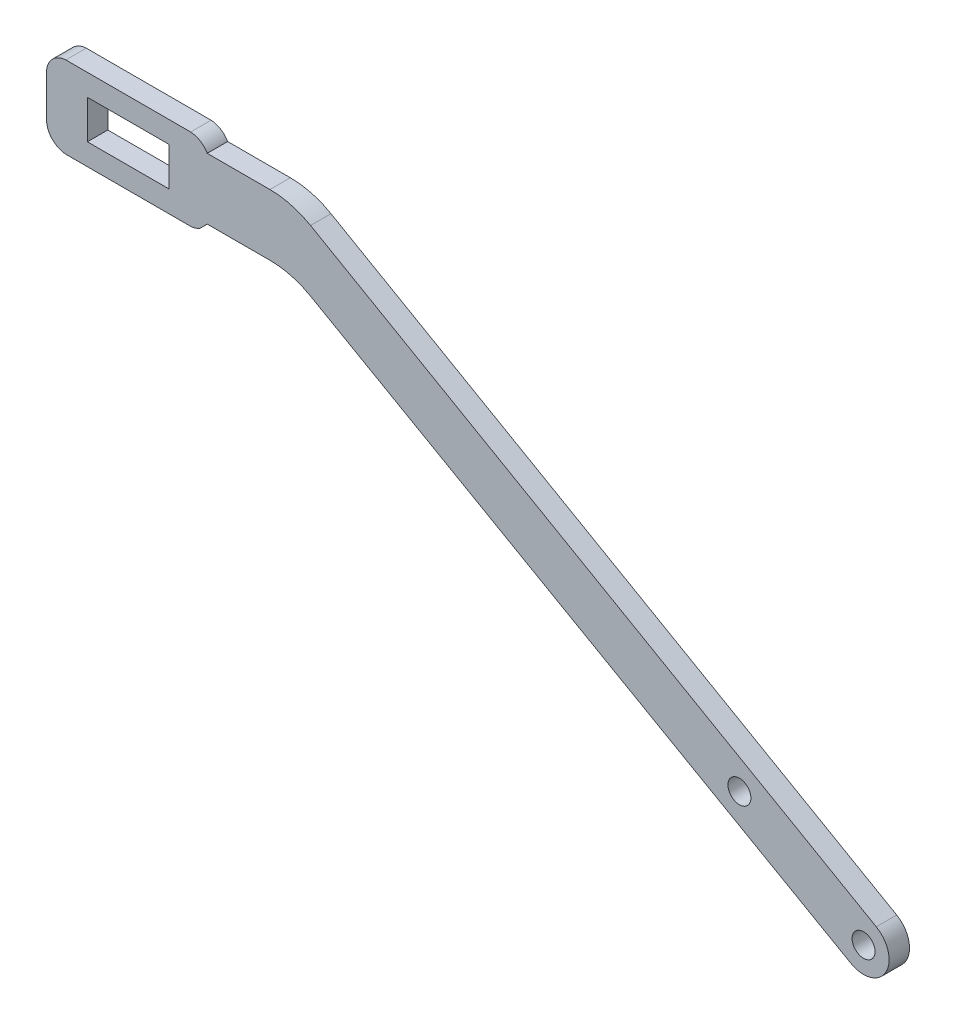
ISO-10303-21;
HEADER;
FILE_DESCRIPTION(('STEP AP214'),'2;1');
FILE_NAME('part.step','',(''),(''),'','','');
FILE_SCHEMA(('AUTOMOTIVE_DESIGN { 1 0 10303 214 1 1 1 1 }'));
ENDSEC;
DATA;
#1=APPLICATION_CONTEXT('core data for automotive mechanical design processes');
#2=APPLICATION_PROTOCOL_DEFINITION('international standard','automotive_design',2000,#1);
#3=PRODUCT_CONTEXT('',#1,'mechanical');
#4=PRODUCT('Part','Part','',(#3));
#5=PRODUCT_RELATED_PRODUCT_CATEGORY('part','',(#4));
#6=PRODUCT_DEFINITION_FORMATION('','',#4);
#7=PRODUCT_DEFINITION_CONTEXT('part definition',#1,'design');
#8=PRODUCT_DEFINITION('design','',#6,#7);
#9=PRODUCT_DEFINITION_SHAPE('','',#8);
#10=(LENGTH_UNIT() NAMED_UNIT(*) SI_UNIT(.MILLI.,.METRE.));
#11=(NAMED_UNIT(*) PLANE_ANGLE_UNIT() SI_UNIT($,.RADIAN.));
#12=(NAMED_UNIT(*) SI_UNIT($,.STERADIAN.) SOLID_ANGLE_UNIT());
#13=UNCERTAINTY_MEASURE_WITH_UNIT(LENGTH_MEASURE(1.E-05),#10,'distance_accuracy_value','');
#14=(GEOMETRIC_REPRESENTATION_CONTEXT(3) GLOBAL_UNCERTAINTY_ASSIGNED_CONTEXT((#13)) GLOBAL_UNIT_ASSIGNED_CONTEXT((#10,
#11,#12)) REPRESENTATION_CONTEXT('',''));
#15=CARTESIAN_POINT('',(0.,0.,0.));
#16=DIRECTION('',(0.,0.,1.));
#17=DIRECTION('',(1.,0.,0.));
#18=AXIS2_PLACEMENT_3D('',#15,#16,#17);
#19=CARTESIAN_POINT('',(-46.2356020455662,14.881853558672,3.175));
#20=DIRECTION('',(0.,0.,-1.));
#21=DIRECTION('',(-1.,0.,0.));
#22=AXIS2_PLACEMENT_3D('',#19,#20,#21);
#23=PLANE('',#22);
#24=DIRECTION('',(-0.867434207369296,0.497551902705237,0.));
#25=VECTOR('',#24,1.);
#26=CARTESIAN_POINT('',(-11.3062939995603,22.8218408101932,3.175));
#27=LINE('',#26,#25);
#28=CARTESIAN_POINT('',(79.5640570682952,-29.3005169308311,3.175));
#29=VERTEX_POINT('',#28);
#30=CARTESIAN_POINT('',(-8.37112341052855,21.1382552437832,3.175));
#31=VERTEX_POINT('',#30);
#32=EDGE_CURVE('E227',#29,#31,#27,.T.);
#33=ORIENTED_EDGE('',*,*,#32,.T.);
#34=CARTESIAN_POINT('',(-14.6900325748851,10.1218408101932,3.175));
#35=DIRECTION('',(0.,0.,-1.));
#36=DIRECTION('',(-1.,0.,0.));
#37=AXIS2_PLACEMENT_3D('',#34,#35,#36);
#38=CIRCLE('',#37,12.7);
#39=CARTESIAN_POINT('',(-14.6900325748851,22.8218408101932,3.175));
#40=VERTEX_POINT('',#39);
#41=EDGE_CURVE('E308',#31,#40,#38,.F.);
#42=ORIENTED_EDGE('',*,*,#41,.T.);
#43=DIRECTION('',(-1.,0.,0.));
#44=VECTOR('',#43,1.);
#45=CARTESIAN_POINT('',(-11.3062939995603,22.8218408101932,3.175));
#46=LINE('',#45,#44);
#47=CARTESIAN_POINT('',(-24.4316633425447,22.8218408101932,3.175));
#48=VERTEX_POINT('',#47);
#49=EDGE_CURVE('E229',#40,#48,#46,.T.);
#50=ORIENTED_EDGE('',*,*,#49,.T.);
#51=CARTESIAN_POINT('',(-27.1856020455662,21.231853558672,3.175));
#52=DIRECTION('',(0.,0.,1.));
#53=DIRECTION('',(-1.,0.,0.));
#54=AXIS2_PLACEMENT_3D('',#51,#52,#53);
#55=CIRCLE('',#54,3.17997450304244);
#56=CARTESIAN_POINT('',(-27.0078020455662,24.406853558672,3.175));
#57=VERTEX_POINT('',#56);
#58=EDGE_CURVE('E231',#48,#57,#55,.T.);
#59=ORIENTED_EDGE('',*,*,#58,.T.);
#60=DIRECTION('',(-1.,0.,0.));
#61=VECTOR('',#60,1.);
#62=CARTESIAN_POINT('',(-27.0078020455662,24.406853558672,3.175));
#63=LINE('',#62,#61);
#64=CARTESIAN_POINT('',(-46.4134020455663,24.406853558672,3.175));
#65=VERTEX_POINT('',#64);
#66=EDGE_CURVE('E233',#57,#65,#63,.T.);
#67=ORIENTED_EDGE('',*,*,#66,.T.);
#68=CARTESIAN_POINT('',(-46.2356020455662,21.231853558672,3.175));
#69=DIRECTION('',(0.,0.,1.));
#70=DIRECTION('',(1.,0.,0.));
#71=AXIS2_PLACEMENT_3D('',#68,#69,#70);
#72=CIRCLE('',#71,3.17997450304244);
#73=CARTESIAN_POINT('',(-49.4155765486087,21.231853558672,3.175));
#74=VERTEX_POINT('',#73);
#75=EDGE_CURVE('E235',#65,#74,#72,.T.);
#76=ORIENTED_EDGE('',*,*,#75,.T.);
#77=DIRECTION('',(0.,-1.,0.));
#78=VECTOR('',#77,1.);
#79=CARTESIAN_POINT('',(-49.4155765486087,14.881853558672,3.175));
#80=LINE('',#79,#78);
#81=CARTESIAN_POINT('',(-49.4155765486087,14.881853558672,3.175));
#82=VERTEX_POINT('',#81);
#83=EDGE_CURVE('E237',#74,#82,#80,.T.);
#84=ORIENTED_EDGE('',*,*,#83,.T.);
#85=CARTESIAN_POINT('',(-46.2356020455662,14.881853558672,3.175));
#86=DIRECTION('',(0.,0.,1.));
#87=DIRECTION('',(-1.,0.,0.));
#88=AXIS2_PLACEMENT_3D('',#85,#86,#87);
#89=CIRCLE('',#88,3.17997450304244);
#90=CARTESIAN_POINT('',(-46.4134020455663,11.706853558672,3.175));
#91=VERTEX_POINT('',#90);
#92=EDGE_CURVE('E210',#82,#91,#89,.T.);
#93=ORIENTED_EDGE('',*,*,#92,.T.);
#94=DIRECTION('',(1.,0.,0.));
#95=VECTOR('',#94,1.);
#96=CARTESIAN_POINT('',(-27.0078020455662,11.706853558672,3.175));
#97=LINE('',#96,#95);
#98=CARTESIAN_POINT('',(-27.0078020455662,11.706853558672,3.175));
#99=VERTEX_POINT('',#98);
#100=EDGE_CURVE('E213',#91,#99,#97,.T.);
#101=ORIENTED_EDGE('',*,*,#100,.T.);
#102=CARTESIAN_POINT('',(-27.1856020455662,14.881853558672,3.175));
#103=DIRECTION('',(0.,0.,1.));
#104=DIRECTION('',(1.,0.,0.));
#105=AXIS2_PLACEMENT_3D('',#102,#103,#104);
#106=CIRCLE('',#105,3.17997450304244);
#107=CARTESIAN_POINT('',(-25.595614794045,12.1279148556504,3.175));
#108=VERTEX_POINT('',#107);
#109=EDGE_CURVE('E216',#99,#108,#106,.T.);
#110=ORIENTED_EDGE('',*,*,#109,.T.);
#111=DIRECTION('',(0.705597380355969,0.708612966883047,0.));
#112=VECTOR('',#111,1.);
#113=CARTESIAN_POINT('',(-25.595614794045,12.1279148556504,3.175));
#114=LINE('',#113,#112);
#115=CARTESIAN_POINT('',(-24.4316633425447,13.2968408101932,3.175));
#116=VERTEX_POINT('',#115);
#117=EDGE_CURVE('E218',#108,#116,#114,.T.);
#118=ORIENTED_EDGE('',*,*,#117,.T.);
#119=DIRECTION('',(1.,0.,0.));
#120=VECTOR('',#119,1.);
#121=CARTESIAN_POINT('',(-11.3062939995603,13.2968408101932,3.175));
#122=LINE('',#121,#120);
#123=CARTESIAN_POINT('',(-14.6679580258952,13.2968408101932,3.175));
#124=VERTEX_POINT('',#123);
#125=EDGE_CURVE('E220',#116,#124,#122,.T.);
#126=ORIENTED_EDGE('',*,*,#125,.T.);
#127=CARTESIAN_POINT('',(-14.6679580258952,0.596840810193181,3.175));
#128=DIRECTION('',(0.,0.,-1.));
#129=DIRECTION('',(-1.,0.,0.));
#130=AXIS2_PLACEMENT_3D('',#127,#128,#129);
#131=CIRCLE('',#130,12.7);
#132=CARTESIAN_POINT('',(-8.38485559112707,11.6337164457257,3.175));
#133=VERTEX_POINT('',#132);
#134=EDGE_CURVE('E11',#124,#133,#131,.T.);
#135=ORIENTED_EDGE('',*,*,#134,.T.);
#136=DIRECTION('',(0.869045325632478,-0.494732475178595,0.));
#137=VECTOR('',#136,1.);
#138=CARTESIAN_POINT('',(-11.3062939995603,13.2968408101932,3.175));
#139=LINE('',#138,#137);
#140=CARTESIAN_POINT('',(75.6259284435687,-36.1921700774319,3.175));
#141=VERTEX_POINT('',#140);
#142=EDGE_CURVE('E223',#133,#141,#139,.T.);
#143=ORIENTED_EDGE('',*,*,#142,.T.);
#144=CARTESIAN_POINT('',(77.5893979544337,-32.743146441328,3.175));
#145=DIRECTION('',(0.,0.,1.));
#146=DIRECTION('',(1.,0.,0.));
#147=AXIS2_PLACEMENT_3D('',#144,#145,#146);
#148=CIRCLE('',#147,3.96875);
#149=EDGE_CURVE('E225',#141,#29,#148,.T.);
#150=ORIENTED_EDGE('',*,*,#149,.T.);
#151=EDGE_LOOP('',(#33,#42,#50,#59,#67,#76,#84,#93,#101,#110,#118,#126,#135,#143,#150));
#152=FACE_BOUND('',#151,.T.);
#153=DIRECTION('',(0.,-1.,0.));
#154=VECTOR('',#153,1.);
#155=CARTESIAN_POINT('',(-43.0606020455662,15.059653558672,3.175));
#156=LINE('',#155,#154);
#157=CARTESIAN_POINT('',(-43.0606020455662,21.054053558672,3.175));
#158=VERTEX_POINT('',#157);
#159=CARTESIAN_POINT('',(-43.0606020455662,15.059653558672,3.175));
#160=VERTEX_POINT('',#159);
#161=EDGE_CURVE('E166',#158,#160,#156,.T.);
#162=ORIENTED_EDGE('',*,*,#161,.F.);
#163=DIRECTION('',(-1.,0.,0.));
#164=VECTOR('',#163,1.);
#165=CARTESIAN_POINT('',(-30.3606020455662,21.054053558672,3.175));
#166=LINE('',#165,#164);
#167=CARTESIAN_POINT('',(-30.3606020455662,21.054053558672,3.175));
#168=VERTEX_POINT('',#167);
#169=EDGE_CURVE('E192',#168,#158,#166,.T.);
#170=ORIENTED_EDGE('',*,*,#169,.F.);
#171=DIRECTION('',(0.,1.,0.));
#172=VECTOR('',#171,1.);
#173=CARTESIAN_POINT('',(-30.3606020455662,15.059653558672,3.175));
#174=LINE('',#173,#172);
#175=CARTESIAN_POINT('',(-30.3606020455662,15.059653558672,3.175));
#176=VERTEX_POINT('',#175);
#177=EDGE_CURVE('E190',#176,#168,#174,.T.);
#178=ORIENTED_EDGE('',*,*,#177,.F.);
#179=DIRECTION('',(1.,0.,0.));
#180=VECTOR('',#179,1.);
#181=CARTESIAN_POINT('',(-30.3606020455662,15.059653558672,3.175));
#182=LINE('',#181,#180);
#183=EDGE_CURVE('E176',#160,#176,#182,.T.);
#184=ORIENTED_EDGE('',*,*,#183,.F.);
#185=EDGE_LOOP('',(#162,#170,#178,#184));
#186=FACE_BOUND('',#185,.T.);
#187=CARTESIAN_POINT('',(77.5893979544337,-32.743146441328,3.175));
#188=DIRECTION('',(0.,0.,1.));
#189=DIRECTION('',(1.,0.,0.));
#190=AXIS2_PLACEMENT_3D('',#187,#188,#189);
#191=CIRCLE('',#190,1.7859375);
#192=CARTESIAN_POINT('',(79.3753354544338,-32.743146441328,3.175));
#193=VERTEX_POINT('',#192);
#194=EDGE_CURVE('E199',#193,#193,#191,.T.);
#195=ORIENTED_EDGE('',*,*,#194,.F.);
#196=EDGE_LOOP('',(#195));
#197=FACE_BOUND('',#196,.T.);
#198=CARTESIAN_POINT('',(58.2927437088372,-21.7163717575912,3.175));
#199=DIRECTION('',(0.,0.,1.));
#200=DIRECTION('',(1.,0.,0.));
#201=AXIS2_PLACEMENT_3D('',#198,#199,#200);
#202=CIRCLE('',#201,1.78600099999999);
#203=CARTESIAN_POINT('',(60.0787447088372,-21.7163717575912,3.175));
#204=VERTEX_POINT('',#203);
#205=EDGE_CURVE('E586',#204,#204,#202,.T.);
#206=ORIENTED_EDGE('',*,*,#205,.F.);
#207=EDGE_LOOP('',(#206));
#208=FACE_BOUND('',#207,.T.);
#209=ADVANCED_FACE('F33',(#152,#186,#197,#208),#23,.F.);
#210=CARTESIAN_POINT('',(-46.2356020455662,14.881853558672,0.));
#211=DIRECTION('',(0.,0.,-1.));
#212=DIRECTION('',(-1.,0.,0.));
#213=AXIS2_PLACEMENT_3D('',#210,#211,#212);
#214=PLANE('',#213);
#215=CARTESIAN_POINT('',(58.2927437088372,-21.7163717575912,0.));
#216=DIRECTION('',(0.,0.,1.));
#217=DIRECTION('',(1.,0.,0.));
#218=AXIS2_PLACEMENT_3D('',#215,#216,#217);
#219=CIRCLE('',#218,1.786001);
#220=CARTESIAN_POINT('',(60.0787447088372,-21.7163717575912,0.));
#221=VERTEX_POINT('',#220);
#222=EDGE_CURVE('E583',#221,#221,#219,.T.);
#223=ORIENTED_EDGE('',*,*,#222,.T.);
#224=EDGE_LOOP('',(#223));
#225=FACE_BOUND('',#224,.T.);
#226=DIRECTION('',(-1.,0.,0.));
#227=VECTOR('',#226,1.);
#228=CARTESIAN_POINT('',(-30.3606020455662,21.054053558672,0.));
#229=LINE('',#228,#227);
#230=CARTESIAN_POINT('',(-30.3606020455662,21.054053558672,0.));
#231=VERTEX_POINT('',#230);
#232=CARTESIAN_POINT('',(-43.0606020455662,21.054053558672,0.));
#233=VERTEX_POINT('',#232);
#234=EDGE_CURVE('E177',#231,#233,#229,.T.);
#235=ORIENTED_EDGE('',*,*,#234,.T.);
#236=DIRECTION('',(0.,-1.,0.));
#237=VECTOR('',#236,1.);
#238=CARTESIAN_POINT('',(-43.0606020455662,15.059653558672,0.));
#239=LINE('',#238,#237);
#240=CARTESIAN_POINT('',(-43.0606020455662,15.059653558672,0.));
#241=VERTEX_POINT('',#240);
#242=EDGE_CURVE('E197',#233,#241,#239,.T.);
#243=ORIENTED_EDGE('',*,*,#242,.T.);
#244=DIRECTION('',(1.,0.,0.));
#245=VECTOR('',#244,1.);
#246=CARTESIAN_POINT('',(-30.3606020455662,15.059653558672,0.));
#247=LINE('',#246,#245);
#248=CARTESIAN_POINT('',(-30.3606020455662,15.059653558672,0.));
#249=VERTEX_POINT('',#248);
#250=EDGE_CURVE('E183',#241,#249,#247,.T.);
#251=ORIENTED_EDGE('',*,*,#250,.T.);
#252=DIRECTION('',(0.,1.,0.));
#253=VECTOR('',#252,1.);
#254=CARTESIAN_POINT('',(-30.3606020455662,15.059653558672,0.));
#255=LINE('',#254,#253);
#256=EDGE_CURVE('E201',#249,#231,#255,.T.);
#257=ORIENTED_EDGE('',*,*,#256,.T.);
#258=EDGE_LOOP('',(#235,#243,#251,#257));
#259=FACE_BOUND('',#258,.T.);
#260=DIRECTION('',(-1.,0.,0.));
#261=VECTOR('',#260,1.);
#262=CARTESIAN_POINT('',(-11.3062939995603,22.8218408101932,0.));
#263=LINE('',#262,#261);
#264=CARTESIAN_POINT('',(-14.6900325748851,22.8218408101932,0.));
#265=VERTEX_POINT('',#264);
#266=CARTESIAN_POINT('',(-24.4316633425447,22.8218408101932,0.));
#267=VERTEX_POINT('',#266);
#268=EDGE_CURVE('E257',#265,#267,#263,.T.);
#269=ORIENTED_EDGE('',*,*,#268,.F.);
#270=CARTESIAN_POINT('',(-14.6900325748851,10.1218408101932,0.));
#271=DIRECTION('',(0.,0.,-1.));
#272=DIRECTION('',(-1.,0.,0.));
#273=AXIS2_PLACEMENT_3D('',#270,#271,#272);
#274=CIRCLE('',#273,12.7);
#275=CARTESIAN_POINT('',(-8.37112341052855,21.1382552437832,0.));
#276=VERTEX_POINT('',#275);
#277=EDGE_CURVE('E56',#265,#276,#274,.T.);
#278=ORIENTED_EDGE('',*,*,#277,.T.);
#279=DIRECTION('',(-0.867434207369296,0.497551902705237,0.));
#280=VECTOR('',#279,1.);
#281=CARTESIAN_POINT('',(-11.3062939995603,22.8218408101932,0.));
#282=LINE('',#281,#280);
#283=CARTESIAN_POINT('',(79.5640570682952,-29.3005169308311,0.));
#284=VERTEX_POINT('',#283);
#285=EDGE_CURVE('E255',#284,#276,#282,.T.);
#286=ORIENTED_EDGE('',*,*,#285,.F.);
#287=CARTESIAN_POINT('',(77.5893979544337,-32.743146441328,0.));
#288=DIRECTION('',(0.,0.,1.));
#289=DIRECTION('',(1.,0.,0.));
#290=AXIS2_PLACEMENT_3D('',#287,#288,#289);
#291=CIRCLE('',#290,3.96875);
#292=CARTESIAN_POINT('',(75.6259284435687,-36.1921700774319,0.));
#293=VERTEX_POINT('',#292);
#294=EDGE_CURVE('E253',#293,#284,#291,.T.);
#295=ORIENTED_EDGE('',*,*,#294,.F.);
#296=DIRECTION('',(0.869045325632478,-0.494732475178595,0.));
#297=VECTOR('',#296,1.);
#298=CARTESIAN_POINT('',(12.4117912426417,-0.20545495307046,0.));
#299=LINE('',#298,#297);
#300=CARTESIAN_POINT('',(-8.38485559112706,11.6337164457257,0.));
#301=VERTEX_POINT('',#300);
#302=EDGE_CURVE('E251',#301,#293,#299,.T.);
#303=ORIENTED_EDGE('',*,*,#302,.F.);
#304=CARTESIAN_POINT('',(-14.6679580258952,0.596840810193181,0.));
#305=DIRECTION('',(0.,0.,-1.));
#306=DIRECTION('',(-1.,0.,0.));
#307=AXIS2_PLACEMENT_3D('',#304,#305,#306);
#308=CIRCLE('',#307,12.7);
#309=CARTESIAN_POINT('',(-14.6679580258952,13.2968408101932,0.));
#310=VERTEX_POINT('',#309);
#311=EDGE_CURVE('E41',#301,#310,#308,.F.);
#312=ORIENTED_EDGE('',*,*,#311,.T.);
#313=DIRECTION('',(1.,0.,0.));
#314=VECTOR('',#313,1.);
#315=CARTESIAN_POINT('',(-11.3062939995603,13.2968408101932,0.));
#316=LINE('',#315,#314);
#317=CARTESIAN_POINT('',(-24.4316633425447,13.2968408101932,0.));
#318=VERTEX_POINT('',#317);
#319=EDGE_CURVE('E248',#318,#310,#316,.T.);
#320=ORIENTED_EDGE('',*,*,#319,.F.);
#321=DIRECTION('',(0.705597380355969,0.708612966883047,0.));
#322=VECTOR('',#321,1.);
#323=CARTESIAN_POINT('',(-25.595614794045,12.1279148556504,0.));
#324=LINE('',#323,#322);
#325=CARTESIAN_POINT('',(-25.595614794045,12.1279148556504,0.));
#326=VERTEX_POINT('',#325);
#327=EDGE_CURVE('E246',#326,#318,#324,.T.);
#328=ORIENTED_EDGE('',*,*,#327,.F.);
#329=CARTESIAN_POINT('',(-27.1856020455662,14.881853558672,0.));
#330=DIRECTION('',(0.,0.,1.));
#331=DIRECTION('',(1.,0.,0.));
#332=AXIS2_PLACEMENT_3D('',#329,#330,#331);
#333=CIRCLE('',#332,3.17997450304244);
#334=CARTESIAN_POINT('',(-27.0078020455662,11.706853558672,0.));
#335=VERTEX_POINT('',#334);
#336=EDGE_CURVE('E244',#335,#326,#333,.T.);
#337=ORIENTED_EDGE('',*,*,#336,.F.);
#338=DIRECTION('',(1.,0.,0.));
#339=VECTOR('',#338,1.);
#340=CARTESIAN_POINT('',(-27.0078020455662,11.706853558672,0.));
#341=LINE('',#340,#339);
#342=CARTESIAN_POINT('',(-46.4134020455663,11.706853558672,0.));
#343=VERTEX_POINT('',#342);
#344=EDGE_CURVE('E242',#343,#335,#341,.T.);
#345=ORIENTED_EDGE('',*,*,#344,.F.);
#346=CARTESIAN_POINT('',(-46.2356020455662,14.881853558672,0.));
#347=DIRECTION('',(0.,0.,1.));
#348=DIRECTION('',(-1.,0.,0.));
#349=AXIS2_PLACEMENT_3D('',#346,#347,#348);
#350=CIRCLE('',#349,3.17997450304244);
#351=CARTESIAN_POINT('',(-49.4155765486087,14.881853558672,0.));
#352=VERTEX_POINT('',#351);
#353=EDGE_CURVE('E184',#352,#343,#350,.T.);
#354=ORIENTED_EDGE('',*,*,#353,.F.);
#355=DIRECTION('',(0.,-1.,0.));
#356=VECTOR('',#355,1.);
#357=CARTESIAN_POINT('',(-49.4155765486087,14.881853558672,0.));
#358=LINE('',#357,#356);
#359=CARTESIAN_POINT('',(-49.4155765486087,21.231853558672,0.));
#360=VERTEX_POINT('',#359);
#361=EDGE_CURVE('E214',#360,#352,#358,.T.);
#362=ORIENTED_EDGE('',*,*,#361,.F.);
#363=CARTESIAN_POINT('',(-46.2356020455662,21.231853558672,0.));
#364=DIRECTION('',(0.,0.,1.));
#365=DIRECTION('',(1.,0.,0.));
#366=AXIS2_PLACEMENT_3D('',#363,#364,#365);
#367=CIRCLE('',#366,3.17997450304244);
#368=CARTESIAN_POINT('',(-46.4134020455663,24.406853558672,0.));
#369=VERTEX_POINT('',#368);
#370=EDGE_CURVE('E263',#369,#360,#367,.T.);
#371=ORIENTED_EDGE('',*,*,#370,.F.);
#372=DIRECTION('',(-1.,0.,0.));
#373=VECTOR('',#372,1.);
#374=CARTESIAN_POINT('',(-27.0078020455662,24.406853558672,0.));
#375=LINE('',#374,#373);
#376=CARTESIAN_POINT('',(-27.0078020455662,24.406853558672,0.));
#377=VERTEX_POINT('',#376);
#378=EDGE_CURVE('E261',#377,#369,#375,.T.);
#379=ORIENTED_EDGE('',*,*,#378,.F.);
#380=CARTESIAN_POINT('',(-27.1856020455662,21.231853558672,0.));
#381=DIRECTION('',(0.,0.,1.));
#382=DIRECTION('',(-1.,0.,0.));
#383=AXIS2_PLACEMENT_3D('',#380,#381,#382);
#384=CIRCLE('',#383,3.17997450304244);
#385=EDGE_CURVE('E259',#267,#377,#384,.T.);
#386=ORIENTED_EDGE('',*,*,#385,.F.);
#387=EDGE_LOOP('',(#269,#278,#286,#295,#303,#312,#320,#328,#337,#345,#354,#362,#371,#379,#386));
#388=FACE_BOUND('',#387,.T.);
#389=CARTESIAN_POINT('',(77.5893979544337,-32.743146441328,0.));
#390=DIRECTION('',(0.,0.,1.));
#391=DIRECTION('',(1.,0.,0.));
#392=AXIS2_PLACEMENT_3D('',#389,#390,#391);
#393=CIRCLE('',#392,1.7859375);
#394=CARTESIAN_POINT('',(79.3753354544338,-32.743146441328,0.));
#395=VERTEX_POINT('',#394);
#396=EDGE_CURVE('E589',#395,#395,#393,.T.);
#397=ORIENTED_EDGE('',*,*,#396,.T.);
#398=EDGE_LOOP('',(#397));
#399=FACE_BOUND('',#398,.T.);
#400=ADVANCED_FACE('F311',(#225,#259,#388,#399),#214,.T.);
#401=CARTESIAN_POINT('',(-46.2356020455662,14.881853558672,3.175));
#402=DIRECTION('',(0.,0.,-1.));
#403=DIRECTION('',(-1.,0.,0.));
#404=AXIS2_PLACEMENT_3D('',#401,#402,#403);
#405=CYLINDRICAL_SURFACE('',#404,3.17997450304244);
#406=ORIENTED_EDGE('',*,*,#353,.T.);
#407=DIRECTION('',(0.,0.,-1.));
#408=VECTOR('',#407,1.);
#409=CARTESIAN_POINT('',(-46.4134020455663,11.706853558672,3.175));
#410=LINE('',#409,#408);
#411=EDGE_CURVE('E295',#91,#343,#410,.T.);
#412=ORIENTED_EDGE('',*,*,#411,.F.);
#413=ORIENTED_EDGE('',*,*,#92,.F.);
#414=DIRECTION('',(0.,0.,-1.));
#415=VECTOR('',#414,1.);
#416=CARTESIAN_POINT('',(-49.4155765486087,14.881853558672,3.175));
#417=LINE('',#416,#415);
#418=EDGE_CURVE('E239',#82,#352,#417,.T.);
#419=ORIENTED_EDGE('',*,*,#418,.T.);
#420=EDGE_LOOP('',(#406,#412,#413,#419));
#421=FACE_BOUND('',#420,.T.);
#422=ADVANCED_FACE('F364',(#421),#405,.T.);
#423=CARTESIAN_POINT('',(-27.0078020455662,11.706853558672,3.175));
#424=DIRECTION('',(0.,1.,0.));
#425=DIRECTION('',(-1.,0.,0.));
#426=AXIS2_PLACEMENT_3D('',#423,#424,#425);
#427=PLANE('',#426);
#428=ORIENTED_EDGE('',*,*,#344,.T.);
#429=DIRECTION('',(0.,0.,-1.));
#430=VECTOR('',#429,1.);
#431=CARTESIAN_POINT('',(-27.0078020455662,11.706853558672,3.175));
#432=LINE('',#431,#430);
#433=EDGE_CURVE('E292',#99,#335,#432,.T.);
#434=ORIENTED_EDGE('',*,*,#433,.F.);
#435=ORIENTED_EDGE('',*,*,#100,.F.);
#436=ORIENTED_EDGE('',*,*,#411,.T.);
#437=EDGE_LOOP('',(#428,#434,#435,#436));
#438=FACE_BOUND('',#437,.T.);
#439=ADVANCED_FACE('F369',(#438),#427,.F.);
#440=CARTESIAN_POINT('',(-27.1856020455662,14.881853558672,3.175));
#441=DIRECTION('',(0.,0.,-1.));
#442=DIRECTION('',(-1.,0.,0.));
#443=AXIS2_PLACEMENT_3D('',#440,#441,#442);
#444=CYLINDRICAL_SURFACE('',#443,3.17997450304244);
#445=ORIENTED_EDGE('',*,*,#336,.T.);
#446=DIRECTION('',(0.,0.,-1.));
#447=VECTOR('',#446,1.);
#448=CARTESIAN_POINT('',(-25.595614794045,12.1279148556504,3.175));
#449=LINE('',#448,#447);
#450=EDGE_CURVE('E289',#108,#326,#449,.T.);
#451=ORIENTED_EDGE('',*,*,#450,.F.);
#452=ORIENTED_EDGE('',*,*,#109,.F.);
#453=ORIENTED_EDGE('',*,*,#433,.T.);
#454=EDGE_LOOP('',(#445,#451,#452,#453));
#455=FACE_BOUND('',#454,.T.);
#456=ADVANCED_FACE('F372',(#455),#444,.T.);
#457=CARTESIAN_POINT('',(-25.595614794045,12.1279148556504,3.175));
#458=DIRECTION('',(-0.708612966883047,0.705597380355969,0.));
#459=DIRECTION('',(-0.705597380355969,-0.708612966883047,0.));
#460=AXIS2_PLACEMENT_3D('',#457,#458,#459);
#461=PLANE('',#460);
#462=ORIENTED_EDGE('',*,*,#327,.T.);
#463=DIRECTION('',(0.,0.,-1.));
#464=VECTOR('',#463,1.);
#465=CARTESIAN_POINT('',(-24.4316633425447,13.2968408101932,3.175));
#466=LINE('',#465,#464);
#467=EDGE_CURVE('E286',#116,#318,#466,.T.);
#468=ORIENTED_EDGE('',*,*,#467,.F.);
#469=ORIENTED_EDGE('',*,*,#117,.F.);
#470=ORIENTED_EDGE('',*,*,#450,.T.);
#471=EDGE_LOOP('',(#462,#468,#469,#470));
#472=FACE_BOUND('',#471,.T.);
#473=ADVANCED_FACE('F375',(#472),#461,.F.);
#474=CARTESIAN_POINT('',(-11.3062939995603,13.2968408101932,3.175));
#475=DIRECTION('',(0.,1.,0.));
#476=DIRECTION('',(-1.,0.,0.));
#477=AXIS2_PLACEMENT_3D('',#474,#475,#476);
#478=PLANE('',#477);
#479=ORIENTED_EDGE('',*,*,#319,.T.);
#480=DIRECTION('',(0.,0.,-1.));
#481=VECTOR('',#480,1.);
#482=CARTESIAN_POINT('',(-14.6679580258952,13.2968408101932,3.175));
#483=LINE('',#482,#481);
#484=EDGE_CURVE('E301',#310,#124,#483,.F.);
#485=ORIENTED_EDGE('',*,*,#484,.T.);
#486=ORIENTED_EDGE('',*,*,#125,.F.);
#487=ORIENTED_EDGE('',*,*,#467,.T.);
#488=EDGE_LOOP('',(#479,#485,#486,#487));
#489=FACE_BOUND('',#488,.T.);
#490=ADVANCED_FACE('F319',(#489),#478,.F.);
#491=CARTESIAN_POINT('',(12.4117912426417,-0.20545495307046,3.175));
#492=DIRECTION('',(0.494732475178595,0.869045325632478,0.));
#493=DIRECTION('',(-0.869045325632479,0.494732475178595,0.));
#494=AXIS2_PLACEMENT_3D('',#491,#492,#493);
#495=PLANE('',#494);
#496=ORIENTED_EDGE('',*,*,#142,.F.);
#497=DIRECTION('',(0.,0.,-1.));
#498=VECTOR('',#497,1.);
#499=CARTESIAN_POINT('',(-8.38485559112707,11.6337164457257,0.));
#500=LINE('',#499,#498);
#501=EDGE_CURVE('E298',#133,#301,#500,.T.);
#502=ORIENTED_EDGE('',*,*,#501,.T.);
#503=ORIENTED_EDGE('',*,*,#302,.T.);
#504=DIRECTION('',(0.,0.,-1.));
#505=VECTOR('',#504,1.);
#506=CARTESIAN_POINT('',(75.6259284435687,-36.1921700774319,3.175));
#507=LINE('',#506,#505);
#508=EDGE_CURVE('E283',#141,#293,#507,.T.);
#509=ORIENTED_EDGE('',*,*,#508,.F.);
#510=EDGE_LOOP('',(#496,#502,#503,#509));
#511=FACE_BOUND('',#510,.T.);
#512=ADVANCED_FACE('F328',(#511),#495,.F.);
#513=CARTESIAN_POINT('',(77.5893979544337,-32.743146441328,3.175));
#514=DIRECTION('',(0.,0.,-1.));
#515=DIRECTION('',(-1.,0.,0.));
#516=AXIS2_PLACEMENT_3D('',#513,#514,#515);
#517=CYLINDRICAL_SURFACE('',#516,3.96875);
#518=ORIENTED_EDGE('',*,*,#294,.T.);
#519=DIRECTION('',(0.,0.,-1.));
#520=VECTOR('',#519,1.);
#521=CARTESIAN_POINT('',(79.5640570682952,-29.3005169308311,3.175));
#522=LINE('',#521,#520);
#523=EDGE_CURVE('E280',#29,#284,#522,.T.);
#524=ORIENTED_EDGE('',*,*,#523,.F.);
#525=ORIENTED_EDGE('',*,*,#149,.F.);
#526=ORIENTED_EDGE('',*,*,#508,.T.);
#527=EDGE_LOOP('',(#518,#524,#525,#526));
#528=FACE_BOUND('',#527,.T.);
#529=ADVANCED_FACE('F332',(#528),#517,.T.);
#530=CARTESIAN_POINT('',(-11.3062939995603,22.8218408101932,3.175));
#531=DIRECTION('',(-0.497551902705237,-0.867434207369296,0.));
#532=DIRECTION('',(0.867434207369296,-0.497551902705237,0.));
#533=AXIS2_PLACEMENT_3D('',#530,#531,#532);
#534=PLANE('',#533);
#535=ORIENTED_EDGE('',*,*,#285,.T.);
#536=DIRECTION('',(0.,0.,-1.));
#537=VECTOR('',#536,1.);
#538=CARTESIAN_POINT('',(-8.37112341052855,21.1382552437832,3.175));
#539=LINE('',#538,#537);
#540=EDGE_CURVE('E48',#276,#31,#539,.F.);
#541=ORIENTED_EDGE('',*,*,#540,.T.);
#542=ORIENTED_EDGE('',*,*,#32,.F.);
#543=ORIENTED_EDGE('',*,*,#523,.T.);
#544=EDGE_LOOP('',(#535,#541,#542,#543));
#545=FACE_BOUND('',#544,.T.);
#546=ADVANCED_FACE('F405',(#545),#534,.F.);
#547=CARTESIAN_POINT('',(-11.3062939995603,22.8218408101932,3.175));
#548=DIRECTION('',(0.,-1.,0.));
#549=DIRECTION('',(1.,0.,0.));
#550=AXIS2_PLACEMENT_3D('',#547,#548,#549);
#551=PLANE('',#550);
#552=ORIENTED_EDGE('',*,*,#49,.F.);
#553=DIRECTION('',(0.,0.,-1.));
#554=VECTOR('',#553,1.);
#555=CARTESIAN_POINT('',(-14.6900325748851,22.8218408101932,3.175));
#556=LINE('',#555,#554);
#557=EDGE_CURVE('E303',#40,#265,#556,.T.);
#558=ORIENTED_EDGE('',*,*,#557,.T.);
#559=ORIENTED_EDGE('',*,*,#268,.T.);
#560=DIRECTION('',(0.,0.,-1.));
#561=VECTOR('',#560,1.);
#562=CARTESIAN_POINT('',(-24.4316633425447,22.8218408101932,3.175));
#563=LINE('',#562,#561);
#564=EDGE_CURVE('E277',#48,#267,#563,.T.);
#565=ORIENTED_EDGE('',*,*,#564,.F.);
#566=EDGE_LOOP('',(#552,#558,#559,#565));
#567=FACE_BOUND('',#566,.T.);
#568=ADVANCED_FACE('F338',(#567),#551,.F.);
#569=CARTESIAN_POINT('',(-27.1856020455662,21.231853558672,3.175));
#570=DIRECTION('',(0.,0.,-1.));
#571=DIRECTION('',(-1.,0.,0.));
#572=AXIS2_PLACEMENT_3D('',#569,#570,#571);
#573=CYLINDRICAL_SURFACE('',#572,3.17997450304244);
#574=ORIENTED_EDGE('',*,*,#385,.T.);
#575=DIRECTION('',(0.,0.,-1.));
#576=VECTOR('',#575,1.);
#577=CARTESIAN_POINT('',(-27.0078020455662,24.406853558672,3.175));
#578=LINE('',#577,#576);
#579=EDGE_CURVE('E274',#57,#377,#578,.T.);
#580=ORIENTED_EDGE('',*,*,#579,.F.);
#581=ORIENTED_EDGE('',*,*,#58,.F.);
#582=ORIENTED_EDGE('',*,*,#564,.T.);
#583=EDGE_LOOP('',(#574,#580,#581,#582));
#584=FACE_BOUND('',#583,.T.);
#585=ADVANCED_FACE('F345',(#584),#573,.T.);
#586=CARTESIAN_POINT('',(-27.0078020455662,24.406853558672,3.175));
#587=DIRECTION('',(0.,-1.,0.));
#588=DIRECTION('',(1.,0.,0.));
#589=AXIS2_PLACEMENT_3D('',#586,#587,#588);
#590=PLANE('',#589);
#591=ORIENTED_EDGE('',*,*,#378,.T.);
#592=DIRECTION('',(0.,0.,-1.));
#593=VECTOR('',#592,1.);
#594=CARTESIAN_POINT('',(-46.4134020455663,24.406853558672,3.175));
#595=LINE('',#594,#593);
#596=EDGE_CURVE('E271',#65,#369,#595,.T.);
#597=ORIENTED_EDGE('',*,*,#596,.F.);
#598=ORIENTED_EDGE('',*,*,#66,.F.);
#599=ORIENTED_EDGE('',*,*,#579,.T.);
#600=EDGE_LOOP('',(#591,#597,#598,#599));
#601=FACE_BOUND('',#600,.T.);
#602=ADVANCED_FACE('F349',(#601),#590,.F.);
#603=CARTESIAN_POINT('',(-46.2356020455662,21.231853558672,3.175));
#604=DIRECTION('',(0.,0.,-1.));
#605=DIRECTION('',(-1.,0.,0.));
#606=AXIS2_PLACEMENT_3D('',#603,#604,#605);
#607=CYLINDRICAL_SURFACE('',#606,3.17997450304244);
#608=ORIENTED_EDGE('',*,*,#370,.T.);
#609=DIRECTION('',(0.,0.,-1.));
#610=VECTOR('',#609,1.);
#611=CARTESIAN_POINT('',(-49.4155765486087,21.231853558672,3.175));
#612=LINE('',#611,#610);
#613=EDGE_CURVE('E268',#74,#360,#612,.T.);
#614=ORIENTED_EDGE('',*,*,#613,.F.);
#615=ORIENTED_EDGE('',*,*,#75,.F.);
#616=ORIENTED_EDGE('',*,*,#596,.T.);
#617=EDGE_LOOP('',(#608,#614,#615,#616));
#618=FACE_BOUND('',#617,.T.);
#619=ADVANCED_FACE('F356',(#618),#607,.T.);
#620=CARTESIAN_POINT('',(-49.4155765486087,14.881853558672,3.175));
#621=DIRECTION('',(1.,0.,0.));
#622=DIRECTION('',(0.,0.,-1.));
#623=AXIS2_PLACEMENT_3D('',#620,#621,#622);
#624=PLANE('',#623);
#625=ORIENTED_EDGE('',*,*,#361,.T.);
#626=ORIENTED_EDGE('',*,*,#418,.F.);
#627=ORIENTED_EDGE('',*,*,#83,.F.);
#628=ORIENTED_EDGE('',*,*,#613,.T.);
#629=EDGE_LOOP('',(#625,#626,#627,#628));
#630=FACE_BOUND('',#629,.T.);
#631=ADVANCED_FACE('F359',(#630),#624,.F.);
#632=CARTESIAN_POINT('',(-43.0606020455662,15.059653558672,3.175));
#633=DIRECTION('',(1.,0.,0.));
#634=DIRECTION('',(0.,1.,0.));
#635=AXIS2_PLACEMENT_3D('',#632,#633,#634);
#636=PLANE('',#635);
#637=ORIENTED_EDGE('',*,*,#242,.F.);
#638=DIRECTION('',(0.,0.,-1.));
#639=VECTOR('',#638,1.);
#640=CARTESIAN_POINT('',(-43.0606020455662,21.054053558672,3.175));
#641=LINE('',#640,#639);
#642=EDGE_CURVE('E172',#158,#233,#641,.T.);
#643=ORIENTED_EDGE('',*,*,#642,.F.);
#644=ORIENTED_EDGE('',*,*,#161,.T.);
#645=DIRECTION('',(0.,0.,-1.));
#646=VECTOR('',#645,1.);
#647=CARTESIAN_POINT('',(-43.0606020455662,15.059653558672,3.175));
#648=LINE('',#647,#646);
#649=EDGE_CURVE('E169',#160,#241,#648,.T.);
#650=ORIENTED_EDGE('',*,*,#649,.T.);
#651=EDGE_LOOP('',(#637,#643,#644,#650));
#652=FACE_BOUND('',#651,.T.);
#653=ADVANCED_FACE('F168',(#652),#636,.T.);
#654=CARTESIAN_POINT('',(-30.3606020455662,15.059653558672,3.175));
#655=DIRECTION('',(0.,1.,0.));
#656=DIRECTION('',(-1.,0.,0.));
#657=AXIS2_PLACEMENT_3D('',#654,#655,#656);
#658=PLANE('',#657);
#659=ORIENTED_EDGE('',*,*,#250,.F.);
#660=ORIENTED_EDGE('',*,*,#649,.F.);
#661=ORIENTED_EDGE('',*,*,#183,.T.);
#662=DIRECTION('',(0.,0.,-1.));
#663=VECTOR('',#662,1.);
#664=CARTESIAN_POINT('',(-30.3606020455662,15.059653558672,3.175));
#665=LINE('',#664,#663);
#666=EDGE_CURVE('E185',#176,#249,#665,.T.);
#667=ORIENTED_EDGE('',*,*,#666,.T.);
#668=EDGE_LOOP('',(#659,#660,#661,#667));
#669=FACE_BOUND('',#668,.T.);
#670=ADVANCED_FACE('F180',(#669),#658,.T.);
#671=CARTESIAN_POINT('',(-30.3606020455662,15.059653558672,3.175));
#672=DIRECTION('',(-1.,0.,0.));
#673=DIRECTION('',(0.,0.,1.));
#674=AXIS2_PLACEMENT_3D('',#671,#672,#673);
#675=PLANE('',#674);
#676=ORIENTED_EDGE('',*,*,#256,.F.);
#677=ORIENTED_EDGE('',*,*,#666,.F.);
#678=ORIENTED_EDGE('',*,*,#177,.T.);
#679=DIRECTION('',(0.,0.,-1.));
#680=VECTOR('',#679,1.);
#681=CARTESIAN_POINT('',(-30.3606020455662,21.054053558672,3.175));
#682=LINE('',#681,#680);
#683=EDGE_CURVE('E207',#168,#231,#682,.T.);
#684=ORIENTED_EDGE('',*,*,#683,.T.);
#685=EDGE_LOOP('',(#676,#677,#678,#684));
#686=FACE_BOUND('',#685,.T.);
#687=ADVANCED_FACE('F455',(#686),#675,.T.);
#688=CARTESIAN_POINT('',(-30.3606020455662,21.054053558672,3.175));
#689=DIRECTION('',(0.,-1.,0.));
#690=DIRECTION('',(1.,0.,0.));
#691=AXIS2_PLACEMENT_3D('',#688,#689,#690);
#692=PLANE('',#691);
#693=ORIENTED_EDGE('',*,*,#234,.F.);
#694=ORIENTED_EDGE('',*,*,#683,.F.);
#695=ORIENTED_EDGE('',*,*,#169,.T.);
#696=ORIENTED_EDGE('',*,*,#642,.T.);
#697=EDGE_LOOP('',(#693,#694,#695,#696));
#698=FACE_BOUND('',#697,.T.);
#699=ADVANCED_FACE('F461',(#698),#692,.T.);
#700=CARTESIAN_POINT('',(77.5893979544337,-32.743146441328,3.175));
#701=DIRECTION('',(0.,0.,-1.));
#702=DIRECTION('',(-1.,0.,0.));
#703=AXIS2_PLACEMENT_3D('',#700,#701,#702);
#704=CYLINDRICAL_SURFACE('',#703,1.7859375);
#705=ORIENTED_EDGE('',*,*,#194,.T.);
#706=EDGE_LOOP('',(#705));
#707=FACE_BOUND('',#706,.T.);
#708=ORIENTED_EDGE('',*,*,#396,.F.);
#709=EDGE_LOOP('',(#708));
#710=FACE_BOUND('',#709,.T.);
#711=ADVANCED_FACE('F469',(#707,#710),#704,.F.);
#712=CARTESIAN_POINT('',(-14.6679580258952,0.596840810193181,3.175));
#713=DIRECTION('',(0.,0.,1.));
#714=DIRECTION('',(1.,0.,0.));
#715=AXIS2_PLACEMENT_3D('',#712,#713,#714);
#716=CYLINDRICAL_SURFACE('',#715,12.7);
#717=ORIENTED_EDGE('',*,*,#134,.F.);
#718=ORIENTED_EDGE('',*,*,#484,.F.);
#719=ORIENTED_EDGE('',*,*,#311,.F.);
#720=ORIENTED_EDGE('',*,*,#501,.F.);
#721=EDGE_LOOP('',(#717,#718,#719,#720));
#722=FACE_BOUND('',#721,.T.);
#723=ADVANCED_FACE('F323',(#722),#716,.F.);
#724=CARTESIAN_POINT('',(-14.6900325748851,10.1218408101932,3.175));
#725=DIRECTION('',(0.,0.,-1.));
#726=DIRECTION('',(-1.,0.,0.));
#727=AXIS2_PLACEMENT_3D('',#724,#725,#726);
#728=CYLINDRICAL_SURFACE('',#727,12.7);
#729=ORIENTED_EDGE('',*,*,#41,.F.);
#730=ORIENTED_EDGE('',*,*,#540,.F.);
#731=ORIENTED_EDGE('',*,*,#277,.F.);
#732=ORIENTED_EDGE('',*,*,#557,.F.);
#733=EDGE_LOOP('',(#729,#730,#731,#732));
#734=FACE_BOUND('',#733,.T.);
#735=ADVANCED_FACE('F35',(#734),#728,.T.);
#736=CARTESIAN_POINT('',(58.2927437088372,-21.7163717575912,3.175));
#737=DIRECTION('',(0.,0.,1.));
#738=DIRECTION('',(1.,0.,0.));
#739=AXIS2_PLACEMENT_3D('',#736,#737,#738);
#740=CYLINDRICAL_SURFACE('',#739,1.786001);
#741=ORIENTED_EDGE('',*,*,#222,.F.);
#742=EDGE_LOOP('',(#741));
#743=FACE_BOUND('',#742,.T.);
#744=ORIENTED_EDGE('',*,*,#205,.T.);
#745=EDGE_LOOP('',(#744));
#746=FACE_BOUND('',#745,.T.);
#747=ADVANCED_FACE('F487',(#743,#746),#740,.F.);
#748=CLOSED_SHELL('',(#209,#400,#422,#439,#456,#473,#490,#512,#529,#546,#568,#585,#602,#619,
#631,#653,#670,#687,#699,#711,#723,#735,#747));
#749=MANIFOLD_SOLID_BREP('B2',#748);
#750=ADVANCED_BREP_SHAPE_REPRESENTATION('',(#18,#749),#14);
#751=SHAPE_DEFINITION_REPRESENTATION(#9,#750);
ENDSEC;
END-ISO-10303-21;
